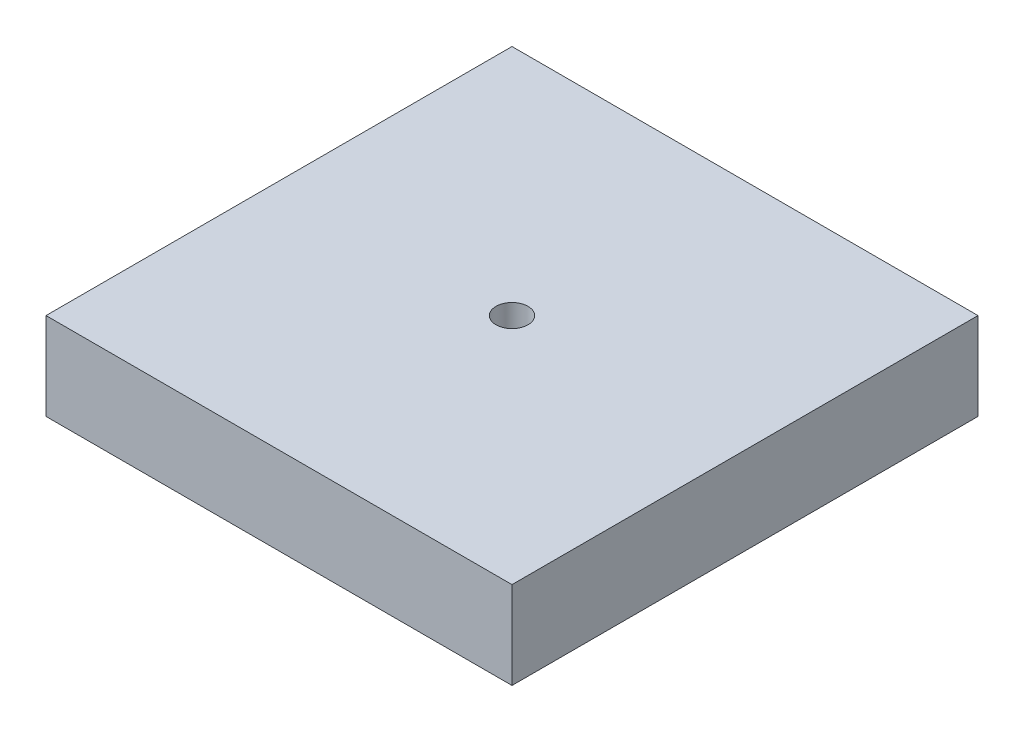
ISO-10303-21;
HEADER;
FILE_DESCRIPTION(('STEP AP214'),'2;1');
FILE_NAME('part.step','',(''),(''),'','','');
FILE_SCHEMA(('AUTOMOTIVE_DESIGN { 1 0 10303 214 1 1 1 1 }'));
ENDSEC;
DATA;
#1=APPLICATION_CONTEXT('core data for automotive mechanical design processes');
#2=APPLICATION_PROTOCOL_DEFINITION('international standard','automotive_design',2000,#1);
#3=PRODUCT_CONTEXT('',#1,'mechanical');
#4=PRODUCT('Part','Part','',(#3));
#5=PRODUCT_RELATED_PRODUCT_CATEGORY('part','',(#4));
#6=PRODUCT_DEFINITION_FORMATION('','',#4);
#7=PRODUCT_DEFINITION_CONTEXT('part definition',#1,'design');
#8=PRODUCT_DEFINITION('design','',#6,#7);
#9=PRODUCT_DEFINITION_SHAPE('','',#8);
#10=(LENGTH_UNIT() NAMED_UNIT(*) SI_UNIT(.MILLI.,.METRE.));
#11=(NAMED_UNIT(*) PLANE_ANGLE_UNIT() SI_UNIT($,.RADIAN.));
#12=(NAMED_UNIT(*) SI_UNIT($,.STERADIAN.) SOLID_ANGLE_UNIT());
#13=UNCERTAINTY_MEASURE_WITH_UNIT(LENGTH_MEASURE(1.E-05),#10,'distance_accuracy_value','');
#14=(GEOMETRIC_REPRESENTATION_CONTEXT(3) GLOBAL_UNCERTAINTY_ASSIGNED_CONTEXT((#13)) GLOBAL_UNIT_ASSIGNED_CONTEXT((#10,
#11,#12)) REPRESENTATION_CONTEXT('',''));
#15=CARTESIAN_POINT('',(0.,0.,0.));
#16=DIRECTION('',(0.,0.,1.));
#17=DIRECTION('',(1.,0.,0.));
#18=AXIS2_PLACEMENT_3D('',#15,#16,#17);
#19=CARTESIAN_POINT('',(-50.8000000000001,19.05,-50.8));
#20=DIRECTION('',(1.,0.,0.));
#21=DIRECTION('',(0.,0.,-1.));
#22=AXIS2_PLACEMENT_3D('',#19,#20,#21);
#23=PLANE('',#22);
#24=DIRECTION('',(0.,0.,1.));
#25=VECTOR('',#24,1.);
#26=CARTESIAN_POINT('',(-50.8000000000001,0.,-50.8));
#27=LINE('',#26,#25);
#28=CARTESIAN_POINT('',(-50.8000000000001,0.,-50.8));
#29=VERTEX_POINT('',#28);
#30=CARTESIAN_POINT('',(-50.8000000000001,0.,50.8));
#31=VERTEX_POINT('',#30);
#32=EDGE_CURVE('E96',#29,#31,#27,.T.);
#33=ORIENTED_EDGE('',*,*,#32,.T.);
#34=DIRECTION('',(0.,-1.,0.));
#35=VECTOR('',#34,1.);
#36=CARTESIAN_POINT('',(-50.8000000000001,19.05,50.8));
#37=LINE('',#36,#35);
#38=CARTESIAN_POINT('',(-50.8000000000001,19.05,50.8));
#39=VERTEX_POINT('',#38);
#40=EDGE_CURVE('E11',#39,#31,#37,.T.);
#41=ORIENTED_EDGE('',*,*,#40,.F.);
#42=DIRECTION('',(0.,0.,1.));
#43=VECTOR('',#42,1.);
#44=CARTESIAN_POINT('',(-50.8000000000001,19.05,-50.8));
#45=LINE('',#44,#43);
#46=CARTESIAN_POINT('',(-50.8000000000001,19.05,-50.8));
#47=VERTEX_POINT('',#46);
#48=EDGE_CURVE('E84',#47,#39,#45,.T.);
#49=ORIENTED_EDGE('',*,*,#48,.F.);
#50=DIRECTION('',(0.,-1.,0.));
#51=VECTOR('',#50,1.);
#52=CARTESIAN_POINT('',(-50.8000000000001,19.05,-50.8));
#53=LINE('',#52,#51);
#54=EDGE_CURVE('E92',#47,#29,#53,.T.);
#55=ORIENTED_EDGE('',*,*,#54,.T.);
#56=EDGE_LOOP('',(#33,#41,#49,#55));
#57=FACE_BOUND('',#56,.T.);
#58=ADVANCED_FACE('F33',(#57),#23,.F.);
#59=CARTESIAN_POINT('',(50.7999999999999,19.05,50.7999999999999));
#60=DIRECTION('',(0.,0.,-1.));
#61=DIRECTION('',(-1.,0.,0.));
#62=AXIS2_PLACEMENT_3D('',#59,#60,#61);
#63=PLANE('',#62);
#64=DIRECTION('',(1.,0.,0.));
#65=VECTOR('',#64,1.);
#66=CARTESIAN_POINT('',(50.7999999999999,0.,50.7999999999999));
#67=LINE('',#66,#65);
#68=CARTESIAN_POINT('',(50.7999999999999,0.,50.7999999999999));
#69=VERTEX_POINT('',#68);
#70=EDGE_CURVE('E88',#31,#69,#67,.T.);
#71=ORIENTED_EDGE('',*,*,#70,.T.);
#72=DIRECTION('',(0.,-1.,0.));
#73=VECTOR('',#72,1.);
#74=CARTESIAN_POINT('',(50.7999999999999,19.05,50.7999999999999));
#75=LINE('',#74,#73);
#76=CARTESIAN_POINT('',(50.7999999999999,19.05,50.7999999999999));
#77=VERTEX_POINT('',#76);
#78=EDGE_CURVE('E41',#77,#69,#75,.T.);
#79=ORIENTED_EDGE('',*,*,#78,.F.);
#80=DIRECTION('',(1.,0.,0.));
#81=VECTOR('',#80,1.);
#82=CARTESIAN_POINT('',(50.7999999999999,19.05,50.7999999999999));
#83=LINE('',#82,#81);
#84=EDGE_CURVE('E79',#39,#77,#83,.T.);
#85=ORIENTED_EDGE('',*,*,#84,.F.);
#86=ORIENTED_EDGE('',*,*,#40,.T.);
#87=EDGE_LOOP('',(#71,#79,#85,#86));
#88=FACE_BOUND('',#87,.T.);
#89=ADVANCED_FACE('F87',(#88),#63,.F.);
#90=CARTESIAN_POINT('',(50.7999999999999,19.05,-50.8));
#91=DIRECTION('',(-1.,0.,0.));
#92=DIRECTION('',(0.,0.,1.));
#93=AXIS2_PLACEMENT_3D('',#90,#91,#92);
#94=PLANE('',#93);
#95=DIRECTION('',(0.,0.,-1.));
#96=VECTOR('',#95,1.);
#97=CARTESIAN_POINT('',(50.7999999999999,0.,-50.8));
#98=LINE('',#97,#96);
#99=CARTESIAN_POINT('',(50.7999999999999,0.,-50.8));
#100=VERTEX_POINT('',#99);
#101=EDGE_CURVE('E66',#69,#100,#98,.T.);
#102=ORIENTED_EDGE('',*,*,#101,.T.);
#103=DIRECTION('',(0.,-1.,0.));
#104=VECTOR('',#103,1.);
#105=CARTESIAN_POINT('',(50.7999999999999,19.05,-50.8));
#106=LINE('',#105,#104);
#107=CARTESIAN_POINT('',(50.7999999999999,19.05,-50.8));
#108=VERTEX_POINT('',#107);
#109=EDGE_CURVE('E89',#108,#100,#106,.T.);
#110=ORIENTED_EDGE('',*,*,#109,.F.);
#111=DIRECTION('',(0.,0.,-1.));
#112=VECTOR('',#111,1.);
#113=CARTESIAN_POINT('',(50.7999999999999,19.05,-50.8));
#114=LINE('',#113,#112);
#115=EDGE_CURVE('E82',#77,#108,#114,.T.);
#116=ORIENTED_EDGE('',*,*,#115,.F.);
#117=ORIENTED_EDGE('',*,*,#78,.T.);
#118=EDGE_LOOP('',(#102,#110,#116,#117));
#119=FACE_BOUND('',#118,.T.);
#120=ADVANCED_FACE('F90',(#119),#94,.F.);
#121=CARTESIAN_POINT('',(50.7999999999999,19.05,-50.8));
#122=DIRECTION('',(0.,0.,1.));
#123=DIRECTION('',(1.,0.,0.));
#124=AXIS2_PLACEMENT_3D('',#121,#122,#123);
#125=PLANE('',#124);
#126=DIRECTION('',(-1.,0.,0.));
#127=VECTOR('',#126,1.);
#128=CARTESIAN_POINT('',(50.7999999999999,0.,-50.8));
#129=LINE('',#128,#127);
#130=EDGE_CURVE('E72',#100,#29,#129,.T.);
#131=ORIENTED_EDGE('',*,*,#130,.T.);
#132=ORIENTED_EDGE('',*,*,#54,.F.);
#133=DIRECTION('',(-1.,0.,0.));
#134=VECTOR('',#133,1.);
#135=CARTESIAN_POINT('',(50.7999999999999,19.05,-50.8));
#136=LINE('',#135,#134);
#137=EDGE_CURVE('E49',#108,#47,#136,.T.);
#138=ORIENTED_EDGE('',*,*,#137,.F.);
#139=ORIENTED_EDGE('',*,*,#109,.T.);
#140=EDGE_LOOP('',(#131,#132,#138,#139));
#141=FACE_BOUND('',#140,.T.);
#142=ADVANCED_FACE('F104',(#141),#125,.F.);
#143=CARTESIAN_POINT('',(0.,19.05,0.));
#144=DIRECTION('',(0.,-1.,0.));
#145=DIRECTION('',(0.,0.,-1.));
#146=AXIS2_PLACEMENT_3D('',#143,#144,#145);
#147=PLANE('',#146);
#148=CARTESIAN_POINT('',(-1.11022302462516E-13,19.05,0.));
#149=DIRECTION('',(0.,-1.,0.));
#150=DIRECTION('',(0.,0.,-1.));
#151=AXIS2_PLACEMENT_3D('',#148,#149,#150);
#152=CIRCLE('',#151,3.49250000000001);
#153=CARTESIAN_POINT('',(-1.11022302462516E-13,19.05,-3.49250000000002));
#154=VERTEX_POINT('',#153);
#155=EDGE_CURVE('E99',#154,#154,#152,.T.);
#156=ORIENTED_EDGE('',*,*,#155,.T.);
#157=EDGE_LOOP('',(#156));
#158=FACE_BOUND('',#157,.T.);
#159=ORIENTED_EDGE('',*,*,#48,.T.);
#160=ORIENTED_EDGE('',*,*,#84,.T.);
#161=ORIENTED_EDGE('',*,*,#115,.T.);
#162=ORIENTED_EDGE('',*,*,#137,.T.);
#163=EDGE_LOOP('',(#159,#160,#161,#162));
#164=FACE_BOUND('',#163,.T.);
#165=ADVANCED_FACE('F80',(#158,#164),#147,.F.);
#166=CARTESIAN_POINT('',(0.,0.,0.));
#167=DIRECTION('',(0.,-1.,0.));
#168=DIRECTION('',(0.,0.,-1.));
#169=AXIS2_PLACEMENT_3D('',#166,#167,#168);
#170=PLANE('',#169);
#171=CARTESIAN_POINT('',(-1.11022302462516E-13,0.,0.));
#172=DIRECTION('',(0.,1.,0.));
#173=DIRECTION('',(0.,0.,1.));
#174=AXIS2_PLACEMENT_3D('',#171,#172,#173);
#175=CIRCLE('',#174,3.49250000000001);
#176=CARTESIAN_POINT('',(-1.11022302462516E-13,0.,3.49249999999999));
#177=VERTEX_POINT('',#176);
#178=EDGE_CURVE('E112',#177,#177,#175,.T.);
#179=ORIENTED_EDGE('',*,*,#178,.T.);
#180=EDGE_LOOP('',(#179));
#181=FACE_BOUND('',#180,.T.);
#182=ORIENTED_EDGE('',*,*,#32,.F.);
#183=ORIENTED_EDGE('',*,*,#130,.F.);
#184=ORIENTED_EDGE('',*,*,#101,.F.);
#185=ORIENTED_EDGE('',*,*,#70,.F.);
#186=EDGE_LOOP('',(#182,#183,#184,#185));
#187=FACE_BOUND('',#186,.T.);
#188=ADVANCED_FACE('F107',(#181,#187),#170,.T.);
#189=CARTESIAN_POINT('',(-1.11022302462516E-13,0.,0.));
#190=DIRECTION('',(0.,1.,0.));
#191=DIRECTION('',(0.,0.,1.));
#192=AXIS2_PLACEMENT_3D('',#189,#190,#191);
#193=CYLINDRICAL_SURFACE('',#192,3.49250000000001);
#194=ORIENTED_EDGE('',*,*,#178,.F.);
#195=EDGE_LOOP('',(#194));
#196=FACE_BOUND('',#195,.T.);
#197=ORIENTED_EDGE('',*,*,#155,.F.);
#198=EDGE_LOOP('',(#197));
#199=FACE_BOUND('',#198,.T.);
#200=ADVANCED_FACE('F117',(#196,#199),#193,.F.);
#201=CLOSED_SHELL('',(#58,#89,#120,#142,#165,#188,#200));
#202=MANIFOLD_SOLID_BREP('B2',#201);
#203=ADVANCED_BREP_SHAPE_REPRESENTATION('',(#18,#202),#14);
#204=SHAPE_DEFINITION_REPRESENTATION(#9,#203);
ENDSEC;
END-ISO-10303-21;
